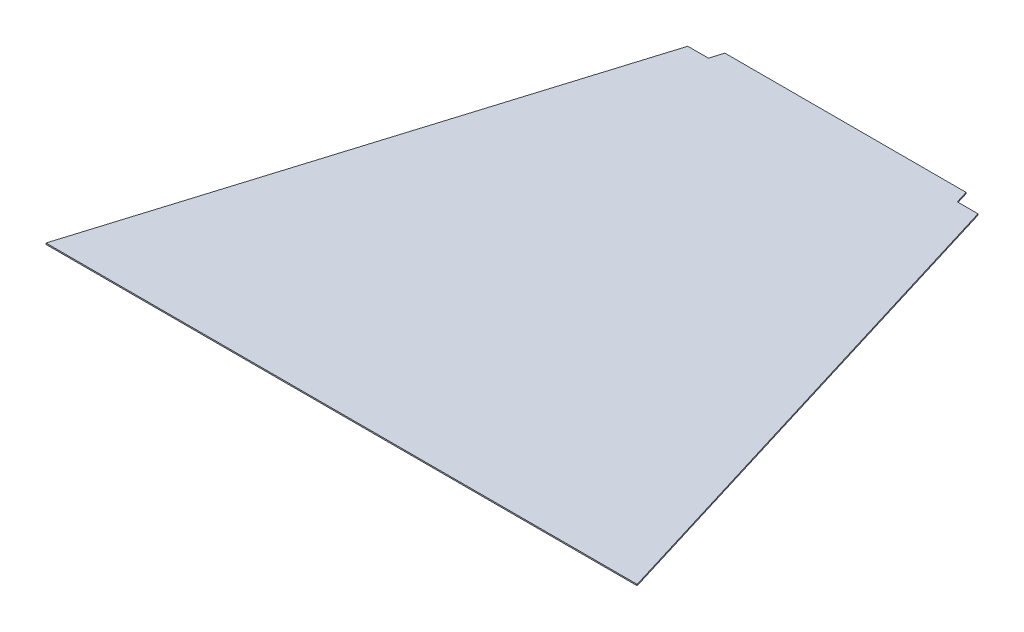
ISO-10303-21;
HEADER;
FILE_DESCRIPTION(('STEP AP214'),'2;1');
FILE_NAME('part.step','',(''),(''),'','','');
FILE_SCHEMA(('AUTOMOTIVE_DESIGN { 1 0 10303 214 1 1 1 1 }'));
ENDSEC;
DATA;
#1=APPLICATION_CONTEXT('core data for automotive mechanical design processes');
#2=APPLICATION_PROTOCOL_DEFINITION('international standard','automotive_design',2000,#1);
#3=PRODUCT_CONTEXT('',#1,'mechanical');
#4=PRODUCT('Part','Part','',(#3));
#5=PRODUCT_RELATED_PRODUCT_CATEGORY('part','',(#4));
#6=PRODUCT_DEFINITION_FORMATION('','',#4);
#7=PRODUCT_DEFINITION_CONTEXT('part definition',#1,'design');
#8=PRODUCT_DEFINITION('design','',#6,#7);
#9=PRODUCT_DEFINITION_SHAPE('','',#8);
#10=(LENGTH_UNIT() NAMED_UNIT(*) SI_UNIT(.MILLI.,.METRE.));
#11=(NAMED_UNIT(*) PLANE_ANGLE_UNIT() SI_UNIT($,.RADIAN.));
#12=(NAMED_UNIT(*) SI_UNIT($,.STERADIAN.) SOLID_ANGLE_UNIT());
#13=UNCERTAINTY_MEASURE_WITH_UNIT(LENGTH_MEASURE(1.E-05),#10,'distance_accuracy_value','');
#14=(GEOMETRIC_REPRESENTATION_CONTEXT(3) GLOBAL_UNCERTAINTY_ASSIGNED_CONTEXT((#13)) GLOBAL_UNIT_ASSIGNED_CONTEXT((#10,
#11,#12)) REPRESENTATION_CONTEXT('',''));
#15=CARTESIAN_POINT('',(0.,0.,0.));
#16=DIRECTION('',(0.,0.,1.));
#17=DIRECTION('',(1.,0.,0.));
#18=AXIS2_PLACEMENT_3D('',#15,#16,#17);
#19=CARTESIAN_POINT('',(151.324264348355,1.5875,-16.1336290315275));
#20=DIRECTION('',(0.,0.,1.));
#21=DIRECTION('',(1.,0.,0.));
#22=AXIS2_PLACEMENT_3D('',#19,#20,#21);
#23=PLANE('',#22);
#24=DIRECTION('',(-1.,0.,0.));
#25=VECTOR('',#24,1.);
#26=CARTESIAN_POINT('',(151.324264348355,0.,-16.1336290315275));
#27=LINE('',#26,#25);
#28=CARTESIAN_POINT('',(177.232264348355,0.,-16.1336290315275));
#29=VERTEX_POINT('',#28);
#30=CARTESIAN_POINT('',(151.324264348355,0.,-16.1336290315275));
#31=VERTEX_POINT('',#30);
#32=EDGE_CURVE('E134',#29,#31,#27,.T.);
#33=ORIENTED_EDGE('',*,*,#32,.T.);
#34=DIRECTION('',(0.,-1.,0.));
#35=VECTOR('',#34,1.);
#36=CARTESIAN_POINT('',(151.324264348355,1.5875,-16.1336290315275));
#37=LINE('',#36,#35);
#38=CARTESIAN_POINT('',(151.324264348355,1.5875,-16.1336290315275));
#39=VERTEX_POINT('',#38);
#40=EDGE_CURVE('E11',#39,#31,#37,.T.);
#41=ORIENTED_EDGE('',*,*,#40,.F.);
#42=DIRECTION('',(-1.,0.,0.));
#43=VECTOR('',#42,1.);
#44=CARTESIAN_POINT('',(151.324264348355,1.5875,-16.1336290315275));
#45=LINE('',#44,#43);
#46=CARTESIAN_POINT('',(177.232264348355,1.5875,-16.1336290315275));
#47=VERTEX_POINT('',#46);
#48=EDGE_CURVE('E148',#47,#39,#45,.T.);
#49=ORIENTED_EDGE('',*,*,#48,.F.);
#50=DIRECTION('',(0.,-1.,0.));
#51=VECTOR('',#50,1.);
#52=CARTESIAN_POINT('',(177.232264348355,1.5875,-16.1336290315275));
#53=LINE('',#52,#51);
#54=EDGE_CURVE('E130',#47,#29,#53,.T.);
#55=ORIENTED_EDGE('',*,*,#54,.T.);
#56=EDGE_LOOP('',(#33,#41,#49,#55));
#57=FACE_BOUND('',#56,.T.);
#58=ADVANCED_FACE('F38',(#57),#23,.F.);
#59=CARTESIAN_POINT('',(151.324264348355,1.5875,-16.1336290315275));
#60=DIRECTION('',(-0.956162432926608,0.,0.292836817801093));
#61=DIRECTION('',(0.292836817801093,0.,0.956162432926608));
#62=AXIS2_PLACEMENT_3D('',#59,#60,#61);
#63=PLANE('',#62);
#64=DIRECTION('',(-0.292836817801093,0.,-0.956162432926608));
#65=VECTOR('',#64,1.);
#66=CARTESIAN_POINT('',(151.324264348355,0.,-16.1336290315275));
#67=LINE('',#66,#65);
#68=CARTESIAN_POINT('',(146.489528486459,0.,-31.9198707991457));
#69=VERTEX_POINT('',#68);
#70=EDGE_CURVE('E137',#31,#69,#67,.T.);
#71=ORIENTED_EDGE('',*,*,#70,.T.);
#72=DIRECTION('',(0.,-1.,0.));
#73=VECTOR('',#72,1.);
#74=CARTESIAN_POINT('',(146.489528486459,1.5875,-31.9198707991457));
#75=LINE('',#74,#73);
#76=CARTESIAN_POINT('',(146.489528486459,1.5875,-31.9198707991457));
#77=VERTEX_POINT('',#76);
#78=EDGE_CURVE('E46',#77,#69,#75,.T.);
#79=ORIENTED_EDGE('',*,*,#78,.F.);
#80=DIRECTION('',(-0.292836817801093,0.,-0.956162432926608));
#81=VECTOR('',#80,1.);
#82=CARTESIAN_POINT('',(151.324264348355,1.5875,-16.1336290315275));
#83=LINE('',#82,#81);
#84=EDGE_CURVE('E97',#39,#77,#83,.T.);
#85=ORIENTED_EDGE('',*,*,#84,.F.);
#86=ORIENTED_EDGE('',*,*,#40,.T.);
#87=EDGE_LOOP('',(#71,#79,#85,#86));
#88=FACE_BOUND('',#87,.T.);
#89=ADVANCED_FACE('F183',(#88),#63,.F.);
#90=CARTESIAN_POINT('',(-155.658099375668,1.5875,-31.9198707991457));
#91=DIRECTION('',(0.,0.,1.));
#92=DIRECTION('',(1.,0.,0.));
#93=AXIS2_PLACEMENT_3D('',#90,#91,#92);
#94=PLANE('',#93);
#95=DIRECTION('',(-1.,0.,0.));
#96=VECTOR('',#95,1.);
#97=CARTESIAN_POINT('',(-155.658099375668,0.,-31.9198707991457));
#98=LINE('',#97,#96);
#99=CARTESIAN_POINT('',(-155.658099375668,0.,-31.9198707991457));
#100=VERTEX_POINT('',#99);
#101=EDGE_CURVE('E139',#69,#100,#98,.T.);
#102=ORIENTED_EDGE('',*,*,#101,.T.);
#103=DIRECTION('',(0.,-1.,0.));
#104=VECTOR('',#103,1.);
#105=CARTESIAN_POINT('',(-155.658099375668,1.5875,-31.9198707991457));
#106=LINE('',#105,#104);
#107=CARTESIAN_POINT('',(-155.658099375668,1.5875,-31.9198707991457));
#108=VERTEX_POINT('',#107);
#109=EDGE_CURVE('E155',#108,#100,#106,.T.);
#110=ORIENTED_EDGE('',*,*,#109,.F.);
#111=DIRECTION('',(-1.,0.,0.));
#112=VECTOR('',#111,1.);
#113=CARTESIAN_POINT('',(-155.658099375668,1.5875,-31.9198707991457));
#114=LINE('',#113,#112);
#115=EDGE_CURVE('E163',#77,#108,#114,.T.);
#116=ORIENTED_EDGE('',*,*,#115,.F.);
#117=ORIENTED_EDGE('',*,*,#78,.T.);
#118=EDGE_LOOP('',(#102,#110,#116,#117));
#119=FACE_BOUND('',#118,.T.);
#120=ADVANCED_FACE('F161',(#119),#94,.F.);
#121=CARTESIAN_POINT('',(-160.492835237564,1.5875,-16.1336290315274));
#122=DIRECTION('',(0.956162432926608,0.,0.292836817801093));
#123=DIRECTION('',(0.292836817801093,0.,-0.956162432926608));
#124=AXIS2_PLACEMENT_3D('',#121,#122,#123);
#125=PLANE('',#124);
#126=DIRECTION('',(-0.292836817801093,0.,0.956162432926608));
#127=VECTOR('',#126,1.);
#128=CARTESIAN_POINT('',(-160.492835237564,0.,-16.1336290315274));
#129=LINE('',#128,#127);
#130=CARTESIAN_POINT('',(-160.492835237564,0.,-16.1336290315274));
#131=VERTEX_POINT('',#130);
#132=EDGE_CURVE('E141',#100,#131,#129,.T.);
#133=ORIENTED_EDGE('',*,*,#132,.T.);
#134=DIRECTION('',(0.,-1.,0.));
#135=VECTOR('',#134,1.);
#136=CARTESIAN_POINT('',(-160.492835237564,1.5875,-16.1336290315274));
#137=LINE('',#136,#135);
#138=CARTESIAN_POINT('',(-160.492835237564,1.5875,-16.1336290315274));
#139=VERTEX_POINT('',#138);
#140=EDGE_CURVE('E152',#139,#131,#137,.T.);
#141=ORIENTED_EDGE('',*,*,#140,.F.);
#142=DIRECTION('',(-0.292836817801093,0.,0.956162432926608));
#143=VECTOR('',#142,1.);
#144=CARTESIAN_POINT('',(-160.492835237564,1.5875,-16.1336290315274));
#145=LINE('',#144,#143);
#146=EDGE_CURVE('E175',#108,#139,#145,.T.);
#147=ORIENTED_EDGE('',*,*,#146,.F.);
#148=ORIENTED_EDGE('',*,*,#109,.T.);
#149=EDGE_LOOP('',(#133,#141,#147,#148));
#150=FACE_BOUND('',#149,.T.);
#151=ADVANCED_FACE('F171',(#150),#125,.F.);
#152=CARTESIAN_POINT('',(-186.400835237564,1.5875,-16.1336290315274));
#153=DIRECTION('',(0.,0.,1.));
#154=DIRECTION('',(1.,0.,0.));
#155=AXIS2_PLACEMENT_3D('',#152,#153,#154);
#156=PLANE('',#155);
#157=DIRECTION('',(-1.,0.,0.));
#158=VECTOR('',#157,1.);
#159=CARTESIAN_POINT('',(-186.400835237564,0.,-16.1336290315274));
#160=LINE('',#159,#158);
#161=CARTESIAN_POINT('',(-186.400835237564,0.,-16.1336290315274));
#162=VERTEX_POINT('',#161);
#163=EDGE_CURVE('E143',#131,#162,#160,.T.);
#164=ORIENTED_EDGE('',*,*,#163,.T.);
#165=DIRECTION('',(0.,-1.,0.));
#166=VECTOR('',#165,1.);
#167=CARTESIAN_POINT('',(-186.400835237564,1.5875,-16.1336290315274));
#168=LINE('',#167,#166);
#169=CARTESIAN_POINT('',(-186.400835237564,1.5875,-16.1336290315274));
#170=VERTEX_POINT('',#169);
#171=EDGE_CURVE('E125',#170,#162,#168,.T.);
#172=ORIENTED_EDGE('',*,*,#171,.F.);
#173=DIRECTION('',(-1.,0.,0.));
#174=VECTOR('',#173,1.);
#175=CARTESIAN_POINT('',(-186.400835237564,1.5875,-16.1336290315274));
#176=LINE('',#175,#174);
#177=EDGE_CURVE('E116',#139,#170,#176,.T.);
#178=ORIENTED_EDGE('',*,*,#177,.F.);
#179=ORIENTED_EDGE('',*,*,#140,.T.);
#180=EDGE_LOOP('',(#164,#172,#178,#179));
#181=FACE_BOUND('',#180,.T.);
#182=ADVANCED_FACE('F174',(#181),#156,.F.);
#183=CARTESIAN_POINT('',(-186.400835237564,1.5875,-16.1336290315274));
#184=DIRECTION('',(0.956162432926608,0.,0.292836817801093));
#185=DIRECTION('',(0.292836817801093,0.,-0.956162432926608));
#186=AXIS2_PLACEMENT_3D('',#183,#184,#185);
#187=PLANE('',#186);
#188=DIRECTION('',(-0.292836817801093,0.,0.956162432926608));
#189=VECTOR('',#188,1.);
#190=CARTESIAN_POINT('',(-186.400835237564,0.,-16.1336290315274));
#191=LINE('',#190,#189);
#192=CARTESIAN_POINT('',(-374.916285391402,0.,599.401646952051));
#193=VERTEX_POINT('',#192);
#194=EDGE_CURVE('E124',#162,#193,#191,.T.);
#195=ORIENTED_EDGE('',*,*,#194,.T.);
#196=DIRECTION('',(0.,-1.,0.));
#197=VECTOR('',#196,1.);
#198=CARTESIAN_POINT('',(-374.916285391402,1.5875,599.401646952051));
#199=LINE('',#198,#197);
#200=CARTESIAN_POINT('',(-374.916285391402,1.5875,599.401646952051));
#201=VERTEX_POINT('',#200);
#202=EDGE_CURVE('E121',#201,#193,#199,.T.);
#203=ORIENTED_EDGE('',*,*,#202,.F.);
#204=DIRECTION('',(-0.292836817801093,0.,0.956162432926608));
#205=VECTOR('',#204,1.);
#206=CARTESIAN_POINT('',(-186.400835237564,1.5875,-16.1336290315274));
#207=LINE('',#206,#205);
#208=EDGE_CURVE('E110',#170,#201,#207,.T.);
#209=ORIENTED_EDGE('',*,*,#208,.F.);
#210=ORIENTED_EDGE('',*,*,#171,.T.);
#211=EDGE_LOOP('',(#195,#203,#209,#210));
#212=FACE_BOUND('',#211,.T.);
#213=ADVANCED_FACE('F122',(#212),#187,.F.);
#214=CARTESIAN_POINT('',(-374.916285391402,1.5875,599.401646952051));
#215=DIRECTION('',(0.,0.,-1.));
#216=DIRECTION('',(-1.,0.,0.));
#217=AXIS2_PLACEMENT_3D('',#214,#215,#216);
#218=PLANE('',#217);
#219=DIRECTION('',(1.,0.,0.));
#220=VECTOR('',#219,1.);
#221=CARTESIAN_POINT('',(-374.916285391402,0.,599.401646952051));
#222=LINE('',#221,#220);
#223=CARTESIAN_POINT('',(365.747714502194,0.,599.401646952051));
#224=VERTEX_POINT('',#223);
#225=EDGE_CURVE('E83',#193,#224,#222,.T.);
#226=ORIENTED_EDGE('',*,*,#225,.T.);
#227=DIRECTION('',(0.,-1.,0.));
#228=VECTOR('',#227,1.);
#229=CARTESIAN_POINT('',(365.747714502194,1.5875,599.401646952051));
#230=LINE('',#229,#228);
#231=CARTESIAN_POINT('',(365.747714502194,1.5875,599.401646952051));
#232=VERTEX_POINT('',#231);
#233=EDGE_CURVE('E126',#232,#224,#230,.T.);
#234=ORIENTED_EDGE('',*,*,#233,.F.);
#235=DIRECTION('',(1.,0.,0.));
#236=VECTOR('',#235,1.);
#237=CARTESIAN_POINT('',(-374.916285391402,1.5875,599.401646952051));
#238=LINE('',#237,#236);
#239=EDGE_CURVE('E114',#201,#232,#238,.T.);
#240=ORIENTED_EDGE('',*,*,#239,.F.);
#241=ORIENTED_EDGE('',*,*,#202,.T.);
#242=EDGE_LOOP('',(#226,#234,#240,#241));
#243=FACE_BOUND('',#242,.T.);
#244=ADVANCED_FACE('F128',(#243),#218,.F.);
#245=CARTESIAN_POINT('',(177.232264348355,1.5875,-16.1336290315275));
#246=DIRECTION('',(-0.956162432926608,0.,0.292836817801094));
#247=DIRECTION('',(0.292836817801094,0.,0.956162432926607));
#248=AXIS2_PLACEMENT_3D('',#245,#246,#247);
#249=PLANE('',#248);
#250=DIRECTION('',(-0.292836817801094,0.,-0.956162432926607));
#251=VECTOR('',#250,1.);
#252=CARTESIAN_POINT('',(177.232264348355,0.,-16.1336290315275));
#253=LINE('',#252,#251);
#254=EDGE_CURVE('E89',#224,#29,#253,.T.);
#255=ORIENTED_EDGE('',*,*,#254,.T.);
#256=ORIENTED_EDGE('',*,*,#54,.F.);
#257=DIRECTION('',(-0.292836817801094,0.,-0.956162432926607));
#258=VECTOR('',#257,1.);
#259=CARTESIAN_POINT('',(177.232264348355,1.5875,-16.1336290315275));
#260=LINE('',#259,#258);
#261=EDGE_CURVE('E54',#232,#47,#260,.T.);
#262=ORIENTED_EDGE('',*,*,#261,.F.);
#263=ORIENTED_EDGE('',*,*,#233,.T.);
#264=EDGE_LOOP('',(#255,#256,#262,#263));
#265=FACE_BOUND('',#264,.T.);
#266=ADVANCED_FACE('F199',(#265),#249,.F.);
#267=CARTESIAN_POINT('',(0.,1.5875,0.));
#268=DIRECTION('',(0.,-1.,0.));
#269=DIRECTION('',(0.,0.,-1.));
#270=AXIS2_PLACEMENT_3D('',#267,#268,#269);
#271=PLANE('',#270);
#272=ORIENTED_EDGE('',*,*,#48,.T.);
#273=ORIENTED_EDGE('',*,*,#84,.T.);
#274=ORIENTED_EDGE('',*,*,#115,.T.);
#275=ORIENTED_EDGE('',*,*,#146,.T.);
#276=ORIENTED_EDGE('',*,*,#177,.T.);
#277=ORIENTED_EDGE('',*,*,#208,.T.);
#278=ORIENTED_EDGE('',*,*,#239,.T.);
#279=ORIENTED_EDGE('',*,*,#261,.T.);
#280=EDGE_LOOP('',(#272,#273,#274,#275,#276,#277,#278,#279));
#281=FACE_BOUND('',#280,.T.);
#282=ADVANCED_FACE('F112',(#281),#271,.F.);
#283=CARTESIAN_POINT('',(0.,0.,0.));
#284=DIRECTION('',(0.,-1.,0.));
#285=DIRECTION('',(0.,0.,-1.));
#286=AXIS2_PLACEMENT_3D('',#283,#284,#285);
#287=PLANE('',#286);
#288=ORIENTED_EDGE('',*,*,#32,.F.);
#289=ORIENTED_EDGE('',*,*,#254,.F.);
#290=ORIENTED_EDGE('',*,*,#225,.F.);
#291=ORIENTED_EDGE('',*,*,#194,.F.);
#292=ORIENTED_EDGE('',*,*,#163,.F.);
#293=ORIENTED_EDGE('',*,*,#132,.F.);
#294=ORIENTED_EDGE('',*,*,#101,.F.);
#295=ORIENTED_EDGE('',*,*,#70,.F.);
#296=EDGE_LOOP('',(#288,#289,#290,#291,#292,#293,#294,#295));
#297=FACE_BOUND('',#296,.T.);
#298=ADVANCED_FACE('F167',(#297),#287,.T.);
#299=CLOSED_SHELL('',(#58,#89,#120,#151,#182,#213,#244,#266,#282,#298));
#300=MANIFOLD_SOLID_BREP('B2',#299);
#301=ADVANCED_BREP_SHAPE_REPRESENTATION('',(#18,#300),#14);
#302=SHAPE_DEFINITION_REPRESENTATION(#9,#301);
ENDSEC;
END-ISO-10303-21;
